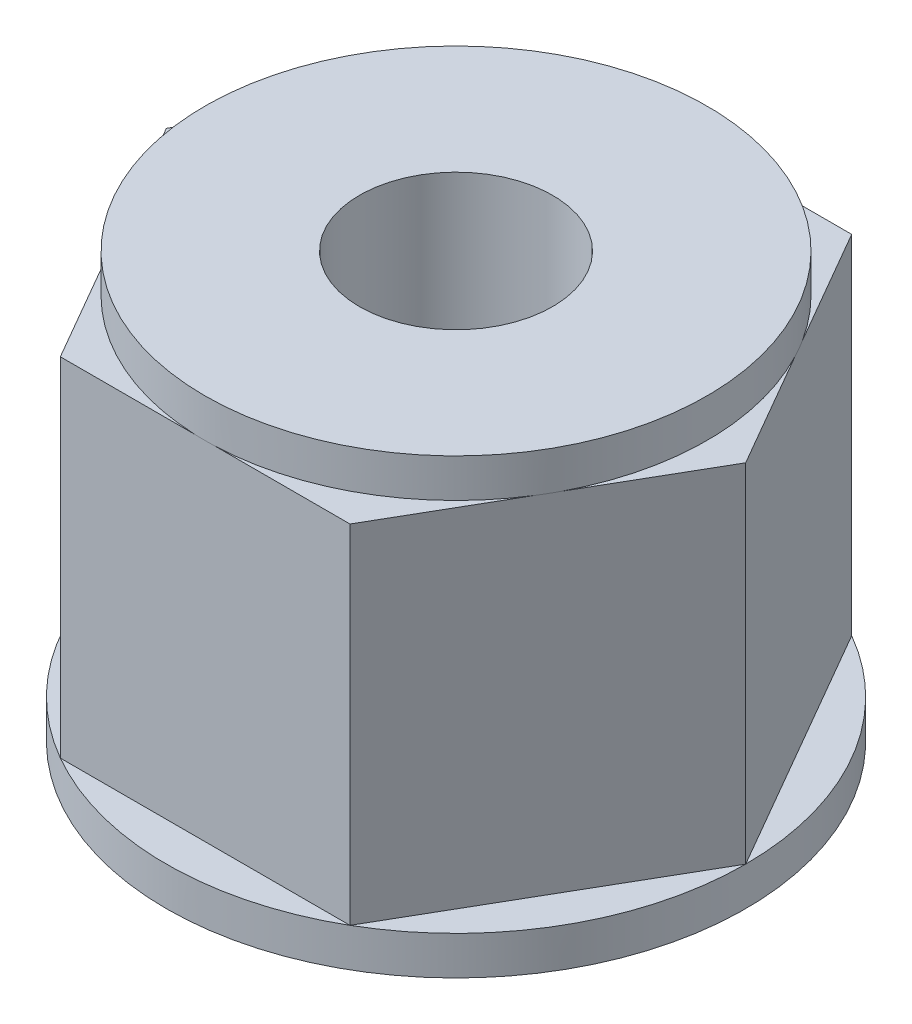
ISO-10303-21;
HEADER;
FILE_DESCRIPTION(('STEP AP214'),'2;1');
FILE_NAME('part.step','',(''),(''),'','','');
FILE_SCHEMA(('AUTOMOTIVE_DESIGN { 1 0 10303 214 1 1 1 1 }'));
ENDSEC;
DATA;
#1=APPLICATION_CONTEXT('core data for automotive mechanical design processes');
#2=APPLICATION_PROTOCOL_DEFINITION('international standard','automotive_design',2000,#1);
#3=PRODUCT_CONTEXT('',#1,'mechanical');
#4=PRODUCT('Part','Part','',(#3));
#5=PRODUCT_RELATED_PRODUCT_CATEGORY('part','',(#4));
#6=PRODUCT_DEFINITION_FORMATION('','',#4);
#7=PRODUCT_DEFINITION_CONTEXT('part definition',#1,'design');
#8=PRODUCT_DEFINITION('design','',#6,#7);
#9=PRODUCT_DEFINITION_SHAPE('','',#8);
#10=(LENGTH_UNIT() NAMED_UNIT(*) SI_UNIT(.MILLI.,.METRE.));
#11=(NAMED_UNIT(*) PLANE_ANGLE_UNIT() SI_UNIT($,.RADIAN.));
#12=(NAMED_UNIT(*) SI_UNIT($,.STERADIAN.) SOLID_ANGLE_UNIT());
#13=UNCERTAINTY_MEASURE_WITH_UNIT(LENGTH_MEASURE(1.E-05),#10,'distance_accuracy_value','');
#14=(GEOMETRIC_REPRESENTATION_CONTEXT(3) GLOBAL_UNCERTAINTY_ASSIGNED_CONTEXT((#13)) GLOBAL_UNIT_ASSIGNED_CONTEXT((#10,
#11,#12)) REPRESENTATION_CONTEXT('',''));
#15=CARTESIAN_POINT('',(0.,0.,0.));
#16=DIRECTION('',(0.,0.,1.));
#17=DIRECTION('',(1.,0.,0.));
#18=AXIS2_PLACEMENT_3D('',#15,#16,#17);
#19=CARTESIAN_POINT('',(0.,10.,0.));
#20=DIRECTION('',(0.,-1.,0.));
#21=DIRECTION('',(0.,0.,-1.));
#22=AXIS2_PLACEMENT_3D('',#19,#20,#21);
#23=PLANE('',#22);
#24=CARTESIAN_POINT('',(0.,10.,0.));
#25=DIRECTION('',(0.,1.,0.));
#26=DIRECTION('',(0.,0.,1.));
#27=AXIS2_PLACEMENT_3D('',#24,#25,#26);
#28=CIRCLE('',#27,6.5);
#29=CARTESIAN_POINT('',(0.250000000000492,10.,6.49519052838327));
#30=VERTEX_POINT('',#29);
#31=CARTESIAN_POINT('',(5.50000000000012,10.,3.46410161513757));
#32=VERTEX_POINT('',#31);
#33=EDGE_CURVE('E189',#30,#32,#28,.T.);
#34=ORIENTED_EDGE('',*,*,#33,.F.);
#35=DIRECTION('',(1.,0.,0.));
#36=VECTOR('',#35,1.);
#37=CARTESIAN_POINT('',(3.75000000000003,10.,6.49519052838327));
#38=LINE('',#37,#36);
#39=CARTESIAN_POINT('',(3.75000000000003,10.,6.49519052838327));
#40=VERTEX_POINT('',#39);
#41=EDGE_CURVE('E144',#30,#40,#38,.T.);
#42=ORIENTED_EDGE('',*,*,#41,.T.);
#43=DIRECTION('',(0.499999999999998,0.,-0.86602540378444));
#44=VECTOR('',#43,1.);
#45=CARTESIAN_POINT('',(7.5,10.,0.));
#46=LINE('',#45,#44);
#47=EDGE_CURVE('E372',#40,#32,#46,.T.);
#48=ORIENTED_EDGE('',*,*,#47,.T.);
#49=EDGE_LOOP('',(#34,#42,#48));
#50=FACE_BOUND('',#49,.T.);
#51=ADVANCED_FACE('F32',(#50),#23,.F.);
#52=CARTESIAN_POINT('',(5.74999999999991,10.,3.0310889132457));
#53=VERTEX_POINT('',#52);
#54=CARTESIAN_POINT('',(5.74999999999991,10.,-3.0310889132457));
#55=VERTEX_POINT('',#54);
#56=EDGE_CURVE('E11',#53,#55,#28,.T.);
#57=ORIENTED_EDGE('',*,*,#56,.F.);
#58=CARTESIAN_POINT('',(7.5,10.,0.));
#59=VERTEX_POINT('',#58);
#60=EDGE_CURVE('E135',#53,#59,#46,.T.);
#61=ORIENTED_EDGE('',*,*,#60,.T.);
#62=DIRECTION('',(-0.499999999999998,0.,-0.86602540378444));
#63=VECTOR('',#62,1.);
#64=CARTESIAN_POINT('',(3.75000000000003,10.,-6.49519052838327));
#65=LINE('',#64,#63);
#66=EDGE_CURVE('E317',#59,#55,#65,.T.);
#67=ORIENTED_EDGE('',*,*,#66,.T.);
#68=EDGE_LOOP('',(#57,#61,#67));
#69=FACE_BOUND('',#68,.T.);
#70=ADVANCED_FACE('F278',(#69),#23,.F.);
#71=CARTESIAN_POINT('',(5.50000000000012,10.,-3.46410161513757));
#72=VERTEX_POINT('',#71);
#73=CARTESIAN_POINT('',(0.250000000000518,10.,-6.49519052838327));
#74=VERTEX_POINT('',#73);
#75=EDGE_CURVE('E42',#72,#74,#28,.T.);
#76=ORIENTED_EDGE('',*,*,#75,.F.);
#77=CARTESIAN_POINT('',(3.75000000000003,10.,-6.49519052838327));
#78=VERTEX_POINT('',#77);
#79=EDGE_CURVE('E367',#72,#78,#65,.T.);
#80=ORIENTED_EDGE('',*,*,#79,.T.);
#81=DIRECTION('',(-1.,0.,0.));
#82=VECTOR('',#81,1.);
#83=CARTESIAN_POINT('',(-3.75000000000003,10.,-6.49519052838327));
#84=LINE('',#83,#82);
#85=EDGE_CURVE('E321',#78,#74,#84,.T.);
#86=ORIENTED_EDGE('',*,*,#85,.T.);
#87=EDGE_LOOP('',(#76,#80,#86));
#88=FACE_BOUND('',#87,.T.);
#89=ADVANCED_FACE('F283',(#88),#23,.F.);
#90=CARTESIAN_POINT('',(-0.250000000000518,10.,-6.49519052838327));
#91=VERTEX_POINT('',#90);
#92=CARTESIAN_POINT('',(-5.50000000000012,10.,-3.46410161513757));
#93=VERTEX_POINT('',#92);
#94=EDGE_CURVE('E156',#91,#93,#28,.T.);
#95=ORIENTED_EDGE('',*,*,#94,.F.);
#96=CARTESIAN_POINT('',(-3.75000000000003,10.,-6.49519052838327));
#97=VERTEX_POINT('',#96);
#98=EDGE_CURVE('E304',#91,#97,#84,.T.);
#99=ORIENTED_EDGE('',*,*,#98,.T.);
#100=DIRECTION('',(-0.499999999999998,0.,0.86602540378444));
#101=VECTOR('',#100,1.);
#102=CARTESIAN_POINT('',(-7.5,10.,0.));
#103=LINE('',#102,#101);
#104=EDGE_CURVE('E306',#97,#93,#103,.T.);
#105=ORIENTED_EDGE('',*,*,#104,.T.);
#106=EDGE_LOOP('',(#95,#99,#105));
#107=FACE_BOUND('',#106,.T.);
#108=ADVANCED_FACE('F293',(#107),#23,.F.);
#109=CARTESIAN_POINT('',(-5.74999999999991,10.,-3.0310889132457));
#110=VERTEX_POINT('',#109);
#111=CARTESIAN_POINT('',(-5.74999999999992,10.,3.0310889132457));
#112=VERTEX_POINT('',#111);
#113=EDGE_CURVE('E50',#110,#112,#28,.T.);
#114=ORIENTED_EDGE('',*,*,#113,.F.);
#115=CARTESIAN_POINT('',(-7.5,10.,0.));
#116=VERTEX_POINT('',#115);
#117=EDGE_CURVE('E322',#110,#116,#103,.T.);
#118=ORIENTED_EDGE('',*,*,#117,.T.);
#119=DIRECTION('',(0.499999999999998,0.,0.86602540378444));
#120=VECTOR('',#119,1.);
#121=CARTESIAN_POINT('',(-3.75000000000003,10.,6.49519052838327));
#122=LINE('',#121,#120);
#123=EDGE_CURVE('E247',#116,#112,#122,.T.);
#124=ORIENTED_EDGE('',*,*,#123,.T.);
#125=EDGE_LOOP('',(#114,#118,#124));
#126=FACE_BOUND('',#125,.T.);
#127=ADVANCED_FACE('F286',(#126),#23,.F.);
#128=CARTESIAN_POINT('',(-5.50000000000012,10.,3.46410161513757));
#129=VERTEX_POINT('',#128);
#130=CARTESIAN_POINT('',(-0.250000000000489,10.,6.49519052838327));
#131=VERTEX_POINT('',#130);
#132=EDGE_CURVE('E130',#129,#131,#28,.T.);
#133=ORIENTED_EDGE('',*,*,#132,.F.);
#134=CARTESIAN_POINT('',(-3.75000000000003,10.,6.49519052838327));
#135=VERTEX_POINT('',#134);
#136=EDGE_CURVE('E36',#129,#135,#122,.T.);
#137=ORIENTED_EDGE('',*,*,#136,.T.);
#138=EDGE_CURVE('E126',#135,#131,#38,.T.);
#139=ORIENTED_EDGE('',*,*,#138,.T.);
#140=EDGE_LOOP('',(#133,#137,#139));
#141=FACE_BOUND('',#140,.T.);
#142=ADVANCED_FACE('F128',(#141),#23,.F.);
#143=CARTESIAN_POINT('',(0.,1.,0.));
#144=DIRECTION('',(0.,1.,0.));
#145=DIRECTION('',(0.,0.,1.));
#146=AXIS2_PLACEMENT_3D('',#143,#144,#145);
#147=PLANE('',#146);
#148=DIRECTION('',(0.499999999999998,0.,0.86602540378444));
#149=VECTOR('',#148,1.);
#150=CARTESIAN_POINT('',(-3.75000000000003,1.,6.49519052838327));
#151=LINE('',#150,#149);
#152=CARTESIAN_POINT('',(-7.5,1.,0.));
#153=VERTEX_POINT('',#152);
#154=CARTESIAN_POINT('',(-3.75000000000003,1.,6.49519052838327));
#155=VERTEX_POINT('',#154);
#156=EDGE_CURVE('E332',#153,#155,#151,.T.);
#157=ORIENTED_EDGE('',*,*,#156,.F.);
#158=CARTESIAN_POINT('',(0.,1.,0.));
#159=DIRECTION('',(0.,1.,0.));
#160=DIRECTION('',(0.,0.,1.));
#161=AXIS2_PLACEMENT_3D('',#158,#159,#160);
#162=CIRCLE('',#161,7.5);
#163=EDGE_CURVE('E412',#153,#155,#162,.T.);
#164=ORIENTED_EDGE('',*,*,#163,.T.);
#165=EDGE_LOOP('',(#157,#164));
#166=FACE_BOUND('',#165,.T.);
#167=ADVANCED_FACE('F269',(#166),#147,.T.);
#168=DIRECTION('',(-0.499999999999998,0.,0.86602540378444));
#169=VECTOR('',#168,1.);
#170=CARTESIAN_POINT('',(-7.5,1.,0.));
#171=LINE('',#170,#169);
#172=CARTESIAN_POINT('',(-3.75000000000003,1.,-6.49519052838327));
#173=VERTEX_POINT('',#172);
#174=EDGE_CURVE('E439',#173,#153,#171,.T.);
#175=ORIENTED_EDGE('',*,*,#174,.F.);
#176=EDGE_CURVE('E415',#173,#153,#162,.T.);
#177=ORIENTED_EDGE('',*,*,#176,.T.);
#178=EDGE_LOOP('',(#175,#177));
#179=FACE_BOUND('',#178,.T.);
#180=ADVANCED_FACE('F291',(#179),#147,.T.);
#181=DIRECTION('',(-1.,0.,0.));
#182=VECTOR('',#181,1.);
#183=CARTESIAN_POINT('',(-3.75000000000003,1.,-6.49519052838327));
#184=LINE('',#183,#182);
#185=CARTESIAN_POINT('',(3.75000000000003,1.,-6.49519052838327));
#186=VERTEX_POINT('',#185);
#187=EDGE_CURVE('E432',#186,#173,#184,.T.);
#188=ORIENTED_EDGE('',*,*,#187,.F.);
#189=EDGE_CURVE('E418',#186,#173,#162,.T.);
#190=ORIENTED_EDGE('',*,*,#189,.T.);
#191=EDGE_LOOP('',(#188,#190));
#192=FACE_BOUND('',#191,.T.);
#193=ADVANCED_FACE('F574',(#192),#147,.T.);
#194=DIRECTION('',(-0.499999999999998,0.,-0.86602540378444));
#195=VECTOR('',#194,1.);
#196=CARTESIAN_POINT('',(3.75000000000003,1.,-6.49519052838327));
#197=LINE('',#196,#195);
#198=CARTESIAN_POINT('',(7.5,1.,0.));
#199=VERTEX_POINT('',#198);
#200=EDGE_CURVE('E429',#199,#186,#197,.T.);
#201=ORIENTED_EDGE('',*,*,#200,.F.);
#202=EDGE_CURVE('E159',#199,#186,#162,.T.);
#203=ORIENTED_EDGE('',*,*,#202,.T.);
#204=EDGE_LOOP('',(#201,#203));
#205=FACE_BOUND('',#204,.T.);
#206=ADVANCED_FACE('F428',(#205),#147,.T.);
#207=DIRECTION('',(0.499999999999998,0.,-0.86602540378444));
#208=VECTOR('',#207,1.);
#209=CARTESIAN_POINT('',(7.5,1.,0.));
#210=LINE('',#209,#208);
#211=CARTESIAN_POINT('',(3.75000000000003,1.,6.49519052838327));
#212=VERTEX_POINT('',#211);
#213=EDGE_CURVE('E391',#212,#199,#210,.T.);
#214=ORIENTED_EDGE('',*,*,#213,.F.);
#215=EDGE_CURVE('E154',#212,#199,#162,.T.);
#216=ORIENTED_EDGE('',*,*,#215,.T.);
#217=EDGE_LOOP('',(#214,#216));
#218=FACE_BOUND('',#217,.T.);
#219=ADVANCED_FACE('F270',(#218),#147,.T.);
#220=CARTESIAN_POINT('',(0.,1.,0.));
#221=DIRECTION('',(0.,-1.,0.));
#222=DIRECTION('',(0.,0.,-1.));
#223=AXIS2_PLACEMENT_3D('',#220,#221,#222);
#224=CYLINDRICAL_SURFACE('',#223,7.5);
#225=ORIENTED_EDGE('',*,*,#215,.F.);
#226=EDGE_CURVE('E161',#155,#212,#162,.T.);
#227=ORIENTED_EDGE('',*,*,#226,.F.);
#228=ORIENTED_EDGE('',*,*,#163,.F.);
#229=ORIENTED_EDGE('',*,*,#176,.F.);
#230=ORIENTED_EDGE('',*,*,#189,.F.);
#231=ORIENTED_EDGE('',*,*,#202,.F.);
#232=EDGE_LOOP('',(#225,#227,#228,#229,#230,#231));
#233=FACE_BOUND('',#232,.T.);
#234=CARTESIAN_POINT('',(0.,0.,0.));
#235=DIRECTION('',(0.,1.,0.));
#236=DIRECTION('',(0.,0.,1.));
#237=AXIS2_PLACEMENT_3D('',#234,#235,#236);
#238=CIRCLE('',#237,7.5);
#239=CARTESIAN_POINT('',(0.,0.,7.5));
#240=VERTEX_POINT('',#239);
#241=EDGE_CURVE('E395',#240,#240,#238,.T.);
#242=ORIENTED_EDGE('',*,*,#241,.T.);
#243=EDGE_LOOP('',(#242));
#244=FACE_BOUND('',#243,.T.);
#245=ADVANCED_FACE('F34',(#233,#244),#224,.T.);
#246=DIRECTION('',(1.,0.,0.));
#247=VECTOR('',#246,1.);
#248=CARTESIAN_POINT('',(3.75000000000003,1.,6.49519052838327));
#249=LINE('',#248,#247);
#250=EDGE_CURVE('E442',#155,#212,#249,.T.);
#251=ORIENTED_EDGE('',*,*,#250,.F.);
#252=ORIENTED_EDGE('',*,*,#226,.T.);
#253=EDGE_LOOP('',(#251,#252));
#254=FACE_BOUND('',#253,.T.);
#255=ADVANCED_FACE('F266',(#254),#147,.T.);
#256=CARTESIAN_POINT('',(0.,0.,0.));
#257=DIRECTION('',(0.,1.,0.));
#258=DIRECTION('',(0.,0.,1.));
#259=AXIS2_PLACEMENT_3D('',#256,#257,#258);
#260=PLANE('',#259);
#261=CARTESIAN_POINT('',(0.,0.,0.));
#262=DIRECTION('',(0.,1.,0.));
#263=DIRECTION('',(0.,0.,1.));
#264=AXIS2_PLACEMENT_3D('',#261,#262,#263);
#265=CIRCLE('',#264,2.5);
#266=CARTESIAN_POINT('',(0.,0.,2.5));
#267=VERTEX_POINT('',#266);
#268=EDGE_CURVE('E192',#267,#267,#265,.T.);
#269=ORIENTED_EDGE('',*,*,#268,.T.);
#270=EDGE_LOOP('',(#269));
#271=FACE_BOUND('',#270,.T.);
#272=ORIENTED_EDGE('',*,*,#241,.F.);
#273=EDGE_LOOP('',(#272));
#274=FACE_BOUND('',#273,.T.);
#275=ADVANCED_FACE('F262',(#271,#274),#260,.F.);
#276=CARTESIAN_POINT('',(-3.75000000000003,10.,6.49519052838327));
#277=DIRECTION('',(0.86602540378444,0.,-0.499999999999998));
#278=DIRECTION('',(-0.499999999999998,0.,-0.86602540378444));
#279=AXIS2_PLACEMENT_3D('',#276,#277,#278);
#280=PLANE('',#279);
#281=ORIENTED_EDGE('',*,*,#156,.T.);
#282=DIRECTION('',(0.,-1.,0.));
#283=VECTOR('',#282,1.);
#284=CARTESIAN_POINT('',(-3.75000000000003,10.,6.49519052838327));
#285=LINE('',#284,#283);
#286=EDGE_CURVE('E392',#135,#155,#285,.T.);
#287=ORIENTED_EDGE('',*,*,#286,.F.);
#288=ORIENTED_EDGE('',*,*,#136,.F.);
#289=CARTESIAN_POINT('',(0.,10.,0.));
#290=DIRECTION('',(0.,1.,0.));
#291=DIRECTION('',(-0.884615384615371,0.,0.466321371268569));
#292=AXIS2_PLACEMENT_3D('',#289,#290,#291);
#293=CIRCLE('',#292,6.5);
#294=EDGE_CURVE('E152',#112,#129,#293,.T.);
#295=ORIENTED_EDGE('',*,*,#294,.F.);
#296=ORIENTED_EDGE('',*,*,#123,.F.);
#297=DIRECTION('',(0.,-1.,0.));
#298=VECTOR('',#297,1.);
#299=CARTESIAN_POINT('',(-7.5,10.,0.));
#300=LINE('',#299,#298);
#301=EDGE_CURVE('E434',#116,#153,#300,.T.);
#302=ORIENTED_EDGE('',*,*,#301,.T.);
#303=EDGE_LOOP('',(#281,#287,#288,#295,#296,#302));
#304=FACE_BOUND('',#303,.T.);
#305=ADVANCED_FACE('F253',(#304),#280,.F.);
#306=CARTESIAN_POINT('',(3.75000000000003,10.,6.49519052838327));
#307=DIRECTION('',(0.,0.,-1.));
#308=DIRECTION('',(-1.,0.,0.));
#309=AXIS2_PLACEMENT_3D('',#306,#307,#308);
#310=PLANE('',#309);
#311=ORIENTED_EDGE('',*,*,#250,.T.);
#312=DIRECTION('',(0.,-1.,0.));
#313=VECTOR('',#312,1.);
#314=CARTESIAN_POINT('',(3.75000000000003,10.,6.49519052838327));
#315=LINE('',#314,#313);
#316=EDGE_CURVE('E389',#40,#212,#315,.T.);
#317=ORIENTED_EDGE('',*,*,#316,.F.);
#318=ORIENTED_EDGE('',*,*,#41,.F.);
#319=CARTESIAN_POINT('',(0.,10.,0.));
#320=DIRECTION('',(0.,1.,0.));
#321=DIRECTION('',(-0.0384615384616138,0.,0.999260081289734));
#322=AXIS2_PLACEMENT_3D('',#319,#320,#321);
#323=CIRCLE('',#322,6.5);
#324=EDGE_CURVE('E136',#131,#30,#323,.T.);
#325=ORIENTED_EDGE('',*,*,#324,.F.);
#326=ORIENTED_EDGE('',*,*,#138,.F.);
#327=ORIENTED_EDGE('',*,*,#286,.T.);
#328=EDGE_LOOP('',(#311,#317,#318,#325,#326,#327));
#329=FACE_BOUND('',#328,.T.);
#330=ADVANCED_FACE('F142',(#329),#310,.F.);
#331=CARTESIAN_POINT('',(7.5,10.,0.));
#332=DIRECTION('',(-0.86602540378444,0.,-0.499999999999998));
#333=DIRECTION('',(-0.499999999999998,0.,0.86602540378444));
#334=AXIS2_PLACEMENT_3D('',#331,#332,#333);
#335=PLANE('',#334);
#336=ORIENTED_EDGE('',*,*,#213,.T.);
#337=DIRECTION('',(0.,-1.,0.));
#338=VECTOR('',#337,1.);
#339=CARTESIAN_POINT('',(7.5,10.,0.));
#340=LINE('',#339,#338);
#341=EDGE_CURVE('E393',#59,#199,#340,.T.);
#342=ORIENTED_EDGE('',*,*,#341,.F.);
#343=ORIENTED_EDGE('',*,*,#60,.F.);
#344=CARTESIAN_POINT('',(0.,10.,0.));
#345=DIRECTION('',(0.,1.,0.));
#346=DIRECTION('',(0.846153846153864,0.,0.532938710021165));
#347=AXIS2_PLACEMENT_3D('',#344,#345,#346);
#348=CIRCLE('',#347,6.5);
#349=EDGE_CURVE('E199',#32,#53,#348,.T.);
#350=ORIENTED_EDGE('',*,*,#349,.F.);
#351=ORIENTED_EDGE('',*,*,#47,.F.);
#352=ORIENTED_EDGE('',*,*,#316,.T.);
#353=EDGE_LOOP('',(#336,#342,#343,#350,#351,#352));
#354=FACE_BOUND('',#353,.T.);
#355=ADVANCED_FACE('F350',(#354),#335,.F.);
#356=CARTESIAN_POINT('',(3.75000000000003,10.,-6.49519052838327));
#357=DIRECTION('',(-0.86602540378444,0.,0.499999999999998));
#358=DIRECTION('',(0.499999999999998,0.,0.86602540378444));
#359=AXIS2_PLACEMENT_3D('',#356,#357,#358);
#360=PLANE('',#359);
#361=ORIENTED_EDGE('',*,*,#200,.T.);
#362=DIRECTION('',(0.,-1.,0.));
#363=VECTOR('',#362,1.);
#364=CARTESIAN_POINT('',(3.75000000000003,10.,-6.49519052838327));
#365=LINE('',#364,#363);
#366=EDGE_CURVE('E397',#78,#186,#365,.T.);
#367=ORIENTED_EDGE('',*,*,#366,.F.);
#368=ORIENTED_EDGE('',*,*,#79,.F.);
#369=CARTESIAN_POINT('',(0.,10.,0.));
#370=DIRECTION('',(0.,1.,0.));
#371=DIRECTION('',(0.884615384615371,0.,-0.466321371268569));
#372=AXIS2_PLACEMENT_3D('',#369,#370,#371);
#373=CIRCLE('',#372,6.5);
#374=EDGE_CURVE('E362',#55,#72,#373,.T.);
#375=ORIENTED_EDGE('',*,*,#374,.F.);
#376=ORIENTED_EDGE('',*,*,#66,.F.);
#377=ORIENTED_EDGE('',*,*,#341,.T.);
#378=EDGE_LOOP('',(#361,#367,#368,#375,#376,#377));
#379=FACE_BOUND('',#378,.T.);
#380=ADVANCED_FACE('F346',(#379),#360,.F.);
#381=CARTESIAN_POINT('',(-3.75000000000003,10.,-6.49519052838327));
#382=DIRECTION('',(0.,0.,1.));
#383=DIRECTION('',(1.,0.,0.));
#384=AXIS2_PLACEMENT_3D('',#381,#382,#383);
#385=PLANE('',#384);
#386=ORIENTED_EDGE('',*,*,#187,.T.);
#387=DIRECTION('',(0.,-1.,0.));
#388=VECTOR('',#387,1.);
#389=CARTESIAN_POINT('',(-3.75000000000003,10.,-6.49519052838327));
#390=LINE('',#389,#388);
#391=EDGE_CURVE('E316',#97,#173,#390,.T.);
#392=ORIENTED_EDGE('',*,*,#391,.F.);
#393=ORIENTED_EDGE('',*,*,#98,.F.);
#394=CARTESIAN_POINT('',(0.,10.,0.));
#395=DIRECTION('',(0.,1.,0.));
#396=DIRECTION('',(0.038461538461618,0.,-0.999260081289734));
#397=AXIS2_PLACEMENT_3D('',#394,#395,#396);
#398=CIRCLE('',#397,6.5);
#399=EDGE_CURVE('E312',#74,#91,#398,.T.);
#400=ORIENTED_EDGE('',*,*,#399,.F.);
#401=ORIENTED_EDGE('',*,*,#85,.F.);
#402=ORIENTED_EDGE('',*,*,#366,.T.);
#403=EDGE_LOOP('',(#386,#392,#393,#400,#401,#402));
#404=FACE_BOUND('',#403,.T.);
#405=ADVANCED_FACE('F310',(#404),#385,.F.);
#406=CARTESIAN_POINT('',(-7.5,10.,0.));
#407=DIRECTION('',(0.86602540378444,0.,0.499999999999998));
#408=DIRECTION('',(0.499999999999998,0.,-0.86602540378444));
#409=AXIS2_PLACEMENT_3D('',#406,#407,#408);
#410=PLANE('',#409);
#411=ORIENTED_EDGE('',*,*,#174,.T.);
#412=ORIENTED_EDGE('',*,*,#301,.F.);
#413=ORIENTED_EDGE('',*,*,#117,.F.);
#414=CARTESIAN_POINT('',(0.,10.,0.));
#415=DIRECTION('',(0.,1.,0.));
#416=DIRECTION('',(-0.846153846153864,0.,-0.532938710021165));
#417=AXIS2_PLACEMENT_3D('',#414,#415,#416);
#418=CIRCLE('',#417,6.5);
#419=EDGE_CURVE('E57',#93,#110,#418,.T.);
#420=ORIENTED_EDGE('',*,*,#419,.F.);
#421=ORIENTED_EDGE('',*,*,#104,.F.);
#422=ORIENTED_EDGE('',*,*,#391,.T.);
#423=EDGE_LOOP('',(#411,#412,#413,#420,#421,#422));
#424=FACE_BOUND('',#423,.T.);
#425=ADVANCED_FACE('F213',(#424),#410,.F.);
#426=CARTESIAN_POINT('',(0.,11.,0.));
#427=DIRECTION('',(0.,-1.,0.));
#428=DIRECTION('',(0.,0.,-1.));
#429=AXIS2_PLACEMENT_3D('',#426,#427,#428);
#430=CYLINDRICAL_SURFACE('',#429,6.5);
#431=CARTESIAN_POINT('',(0.,11.,0.));
#432=DIRECTION('',(0.,1.,0.));
#433=DIRECTION('',(0.,0.,1.));
#434=AXIS2_PLACEMENT_3D('',#431,#432,#433);
#435=CIRCLE('',#434,6.5);
#436=CARTESIAN_POINT('',(0.,11.,6.5));
#437=VERTEX_POINT('',#436);
#438=EDGE_CURVE('E171',#437,#437,#435,.T.);
#439=ORIENTED_EDGE('',*,*,#438,.F.);
#440=EDGE_LOOP('',(#439));
#441=FACE_BOUND('',#440,.T.);
#442=ORIENTED_EDGE('',*,*,#33,.T.);
#443=ORIENTED_EDGE('',*,*,#349,.T.);
#444=ORIENTED_EDGE('',*,*,#56,.T.);
#445=ORIENTED_EDGE('',*,*,#374,.T.);
#446=ORIENTED_EDGE('',*,*,#75,.T.);
#447=ORIENTED_EDGE('',*,*,#399,.T.);
#448=ORIENTED_EDGE('',*,*,#94,.T.);
#449=ORIENTED_EDGE('',*,*,#419,.T.);
#450=ORIENTED_EDGE('',*,*,#113,.T.);
#451=ORIENTED_EDGE('',*,*,#294,.T.);
#452=ORIENTED_EDGE('',*,*,#132,.T.);
#453=ORIENTED_EDGE('',*,*,#324,.T.);
#454=EDGE_LOOP('',(#442,#443,#444,#445,#446,#447,#448,#449,#450,#451,#452,#453));
#455=FACE_BOUND('',#454,.T.);
#456=ADVANCED_FACE('F151',(#441,#455),#430,.T.);
#457=CARTESIAN_POINT('',(0.,11.,0.));
#458=DIRECTION('',(0.,1.,0.));
#459=DIRECTION('',(0.,0.,1.));
#460=AXIS2_PLACEMENT_3D('',#457,#458,#459);
#461=PLANE('',#460);
#462=CARTESIAN_POINT('',(0.,11.,0.));
#463=DIRECTION('',(0.,1.,0.));
#464=DIRECTION('',(0.,0.,1.));
#465=AXIS2_PLACEMENT_3D('',#462,#463,#464);
#466=CIRCLE('',#465,2.5);
#467=CARTESIAN_POINT('',(0.,11.,2.5));
#468=VERTEX_POINT('',#467);
#469=EDGE_CURVE('E456',#468,#468,#466,.T.);
#470=ORIENTED_EDGE('',*,*,#469,.F.);
#471=EDGE_LOOP('',(#470));
#472=FACE_BOUND('',#471,.T.);
#473=ORIENTED_EDGE('',*,*,#438,.T.);
#474=EDGE_LOOP('',(#473));
#475=FACE_BOUND('',#474,.T.);
#476=ADVANCED_FACE('F212',(#472,#475),#461,.T.);
#477=CARTESIAN_POINT('',(0.,0.,0.));
#478=DIRECTION('',(0.,1.,0.));
#479=DIRECTION('',(0.,0.,1.));
#480=AXIS2_PLACEMENT_3D('',#477,#478,#479);
#481=CYLINDRICAL_SURFACE('',#480,2.5);
#482=ORIENTED_EDGE('',*,*,#268,.F.);
#483=EDGE_LOOP('',(#482));
#484=FACE_BOUND('',#483,.T.);
#485=ORIENTED_EDGE('',*,*,#469,.T.);
#486=EDGE_LOOP('',(#485));
#487=FACE_BOUND('',#486,.T.);
#488=ADVANCED_FACE('F448',(#484,#487),#481,.F.);
#489=CLOSED_SHELL('',(#51,#70,#89,#108,#127,#142,#167,#180,#193,#206,#219,#245,#255,#275,#305,
#330,#355,#380,#405,#425,#456,#476,#488));
#490=MANIFOLD_SOLID_BREP('B2',#489);
#491=ADVANCED_BREP_SHAPE_REPRESENTATION('',(#18,#490),#14);
#492=SHAPE_DEFINITION_REPRESENTATION(#9,#491);
ENDSEC;
END-ISO-10303-21;
